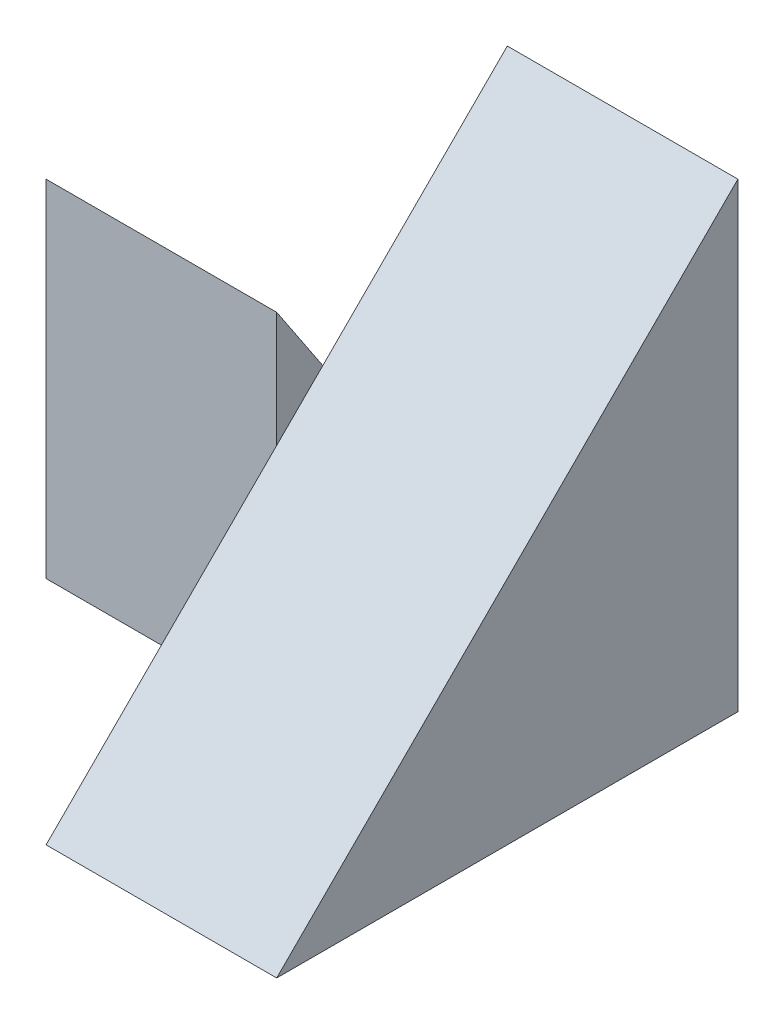
ISO-10303-21;
HEADER;
FILE_DESCRIPTION(('STEP AP214'),'2;1');
FILE_NAME('part.step','',(''),(''),'','','');
FILE_SCHEMA(('AUTOMOTIVE_DESIGN { 1 0 10303 214 1 1 1 1 }'));
ENDSEC;
DATA;
#1=APPLICATION_CONTEXT('core data for automotive mechanical design processes');
#2=APPLICATION_PROTOCOL_DEFINITION('international standard','automotive_design',2000,#1);
#3=PRODUCT_CONTEXT('',#1,'mechanical');
#4=PRODUCT('Part','Part','',(#3));
#5=PRODUCT_RELATED_PRODUCT_CATEGORY('part','',(#4));
#6=PRODUCT_DEFINITION_FORMATION('','',#4);
#7=PRODUCT_DEFINITION_CONTEXT('part definition',#1,'design');
#8=PRODUCT_DEFINITION('design','',#6,#7);
#9=PRODUCT_DEFINITION_SHAPE('','',#8);
#10=(LENGTH_UNIT() NAMED_UNIT(*) SI_UNIT(.MILLI.,.METRE.));
#11=(NAMED_UNIT(*) PLANE_ANGLE_UNIT() SI_UNIT($,.RADIAN.));
#12=(NAMED_UNIT(*) SI_UNIT($,.STERADIAN.) SOLID_ANGLE_UNIT());
#13=UNCERTAINTY_MEASURE_WITH_UNIT(LENGTH_MEASURE(1.E-05),#10,'distance_accuracy_value','');
#14=(GEOMETRIC_REPRESENTATION_CONTEXT(3) GLOBAL_UNCERTAINTY_ASSIGNED_CONTEXT((#13)) GLOBAL_UNIT_ASSIGNED_CONTEXT((#10,
#11,#12)) REPRESENTATION_CONTEXT('',''));
#15=CARTESIAN_POINT('',(0.,0.,0.));
#16=DIRECTION('',(0.,0.,1.));
#17=DIRECTION('',(1.,0.,0.));
#18=AXIS2_PLACEMENT_3D('',#15,#16,#17);
#19=CARTESIAN_POINT('',(0.,0.,0.));
#20=DIRECTION('',(-1.,0.,0.));
#21=DIRECTION('',(0.,0.,1.));
#22=AXIS2_PLACEMENT_3D('',#19,#20,#21);
#23=PLANE('',#22);
#24=DIRECTION('',(0.,0.707106781186548,-0.707106781186548));
#25=VECTOR('',#24,1.);
#26=CARTESIAN_POINT('',(0.,4.,-4.));
#27=LINE('',#26,#25);
#28=CARTESIAN_POINT('',(0.,2.4,-2.4));
#29=VERTEX_POINT('',#28);
#30=CARTESIAN_POINT('',(0.,4.,-4.));
#31=VERTEX_POINT('',#30);
#32=EDGE_CURVE('E96',#29,#31,#27,.T.);
#33=ORIENTED_EDGE('',*,*,#32,.T.);
#34=DIRECTION('',(0.,1.,0.));
#35=VECTOR('',#34,1.);
#36=CARTESIAN_POINT('',(0.,0.,-4.));
#37=LINE('',#36,#35);
#38=CARTESIAN_POINT('',(0.,0.,-4.));
#39=VERTEX_POINT('',#38);
#40=EDGE_CURVE('E102',#39,#31,#37,.T.);
#41=ORIENTED_EDGE('',*,*,#40,.F.);
#42=DIRECTION('',(0.,0.832050294337844,0.554700196225229));
#43=VECTOR('',#42,1.);
#44=CARTESIAN_POINT('',(0.,3.,-2.));
#45=LINE('',#44,#43);
#46=EDGE_CURVE('E145',#39,#29,#45,.T.);
#47=ORIENTED_EDGE('',*,*,#46,.T.);
#48=EDGE_LOOP('',(#33,#41,#47));
#49=FACE_BOUND('',#48,.T.);
#50=ADVANCED_FACE('F33',(#49),#23,.T.);
#51=CARTESIAN_POINT('',(2.,0.,-4.));
#52=DIRECTION('',(0.,0.,1.));
#53=DIRECTION('',(1.,0.,0.));
#54=AXIS2_PLACEMENT_3D('',#51,#52,#53);
#55=PLANE('',#54);
#56=DIRECTION('',(-1.,0.,0.));
#57=VECTOR('',#56,1.);
#58=CARTESIAN_POINT('',(2.,0.,-4.));
#59=LINE('',#58,#57);
#60=CARTESIAN_POINT('',(2.,0.,-4.));
#61=VERTEX_POINT('',#60);
#62=EDGE_CURVE('E42',#61,#39,#59,.T.);
#63=ORIENTED_EDGE('',*,*,#62,.T.);
#64=ORIENTED_EDGE('',*,*,#40,.T.);
#65=DIRECTION('',(-1.,0.,0.));
#66=VECTOR('',#65,1.);
#67=CARTESIAN_POINT('',(2.,4.,-4.));
#68=LINE('',#67,#66);
#69=CARTESIAN_POINT('',(2.,4.,-4.));
#70=VERTEX_POINT('',#69);
#71=EDGE_CURVE('E115',#70,#31,#68,.T.);
#72=ORIENTED_EDGE('',*,*,#71,.F.);
#73=DIRECTION('',(0.,1.,0.));
#74=VECTOR('',#73,1.);
#75=CARTESIAN_POINT('',(2.,0.,-4.));
#76=LINE('',#75,#74);
#77=EDGE_CURVE('E113',#61,#70,#76,.T.);
#78=ORIENTED_EDGE('',*,*,#77,.F.);
#79=EDGE_LOOP('',(#63,#64,#72,#78));
#80=FACE_BOUND('',#79,.T.);
#81=ADVANCED_FACE('F158',(#80),#55,.F.);
#82=CARTESIAN_POINT('',(2.,0.,0.));
#83=DIRECTION('',(0.,1.,0.));
#84=DIRECTION('',(0.,0.,1.));
#85=AXIS2_PLACEMENT_3D('',#82,#83,#84);
#86=PLANE('',#85);
#87=DIRECTION('',(0.,0.,-1.));
#88=VECTOR('',#87,1.);
#89=CARTESIAN_POINT('',(0.,0.,0.));
#90=LINE('',#89,#88);
#91=CARTESIAN_POINT('',(0.,0.,0.));
#92=VERTEX_POINT('',#91);
#93=CARTESIAN_POINT('',(0.,0.,-2.));
#94=VERTEX_POINT('',#93);
#95=EDGE_CURVE('E97',#92,#94,#90,.T.);
#96=ORIENTED_EDGE('',*,*,#95,.T.);
#97=DIRECTION('',(1.,0.,0.));
#98=VECTOR('',#97,1.);
#99=CARTESIAN_POINT('',(-2.,0.,-2.));
#100=LINE('',#99,#98);
#101=CARTESIAN_POINT('',(-2.,0.,-2.));
#102=VERTEX_POINT('',#101);
#103=EDGE_CURVE('E103',#102,#94,#100,.T.);
#104=ORIENTED_EDGE('',*,*,#103,.F.);
#105=DIRECTION('',(0.,0.,1.));
#106=VECTOR('',#105,1.);
#107=CARTESIAN_POINT('',(-2.,0.,-4.));
#108=LINE('',#107,#106);
#109=CARTESIAN_POINT('',(-2.,0.,-4.));
#110=VERTEX_POINT('',#109);
#111=EDGE_CURVE('E129',#110,#102,#108,.T.);
#112=ORIENTED_EDGE('',*,*,#111,.F.);
#113=DIRECTION('',(-1.,0.,0.));
#114=VECTOR('',#113,1.);
#115=CARTESIAN_POINT('',(0.,0.,-4.));
#116=LINE('',#115,#114);
#117=EDGE_CURVE('E130',#39,#110,#116,.T.);
#118=ORIENTED_EDGE('',*,*,#117,.F.);
#119=ORIENTED_EDGE('',*,*,#62,.F.);
#120=DIRECTION('',(0.,0.,-1.));
#121=VECTOR('',#120,1.);
#122=CARTESIAN_POINT('',(2.,0.,0.));
#123=LINE('',#122,#121);
#124=CARTESIAN_POINT('',(2.,0.,0.));
#125=VERTEX_POINT('',#124);
#126=EDGE_CURVE('E107',#125,#61,#123,.T.);
#127=ORIENTED_EDGE('',*,*,#126,.F.);
#128=DIRECTION('',(-1.,0.,0.));
#129=VECTOR('',#128,1.);
#130=CARTESIAN_POINT('',(2.,0.,0.));
#131=LINE('',#130,#129);
#132=EDGE_CURVE('E11',#125,#92,#131,.T.);
#133=ORIENTED_EDGE('',*,*,#132,.T.);
#134=EDGE_LOOP('',(#96,#104,#112,#118,#119,#127,#133));
#135=FACE_BOUND('',#134,.T.);
#136=ADVANCED_FACE('F35',(#135),#86,.F.);
#137=CARTESIAN_POINT('',(2.,0.,0.));
#138=DIRECTION('',(-1.,0.,0.));
#139=DIRECTION('',(0.,0.,1.));
#140=AXIS2_PLACEMENT_3D('',#137,#138,#139);
#141=PLANE('',#140);
#142=ORIENTED_EDGE('',*,*,#77,.T.);
#143=DIRECTION('',(0.,0.707106781186548,-0.707106781186548));
#144=VECTOR('',#143,1.);
#145=CARTESIAN_POINT('',(2.,4.,-4.));
#146=LINE('',#145,#144);
#147=EDGE_CURVE('E152',#125,#70,#146,.T.);
#148=ORIENTED_EDGE('',*,*,#147,.F.);
#149=ORIENTED_EDGE('',*,*,#126,.T.);
#150=EDGE_LOOP('',(#142,#148,#149));
#151=FACE_BOUND('',#150,.T.);
#152=ADVANCED_FACE('F160',(#151),#141,.F.);
#153=CARTESIAN_POINT('',(0.,2.,-2.));
#154=VERTEX_POINT('',#153);
#155=EDGE_CURVE('E91',#92,#154,#27,.T.);
#156=ORIENTED_EDGE('',*,*,#155,.T.);
#157=DIRECTION('',(0.,1.,0.));
#158=VECTOR('',#157,1.);
#159=CARTESIAN_POINT('',(0.,0.,-2.));
#160=LINE('',#159,#158);
#161=EDGE_CURVE('E58',#94,#154,#160,.T.);
#162=ORIENTED_EDGE('',*,*,#161,.F.);
#163=ORIENTED_EDGE('',*,*,#95,.F.);
#164=EDGE_LOOP('',(#156,#162,#163));
#165=FACE_BOUND('',#164,.T.);
#166=ADVANCED_FACE('F98',(#165),#23,.T.);
#167=CARTESIAN_POINT('',(-2.,0.,-2.));
#168=DIRECTION('',(0.,0.,-1.));
#169=DIRECTION('',(-1.,0.,0.));
#170=AXIS2_PLACEMENT_3D('',#167,#168,#169);
#171=PLANE('',#170);
#172=ORIENTED_EDGE('',*,*,#161,.T.);
#173=DIRECTION('',(0.,-1.,0.));
#174=VECTOR('',#173,1.);
#175=CARTESIAN_POINT('',(0.,0.,-2.));
#176=LINE('',#175,#174);
#177=CARTESIAN_POINT('',(0.,3.,-2.));
#178=VERTEX_POINT('',#177);
#179=EDGE_CURVE('E94',#178,#154,#176,.T.);
#180=ORIENTED_EDGE('',*,*,#179,.F.);
#181=DIRECTION('',(1.,0.,0.));
#182=VECTOR('',#181,1.);
#183=CARTESIAN_POINT('',(-2.,3.,-2.));
#184=LINE('',#183,#182);
#185=CARTESIAN_POINT('',(-2.,3.,-2.));
#186=VERTEX_POINT('',#185);
#187=EDGE_CURVE('E120',#186,#178,#184,.T.);
#188=ORIENTED_EDGE('',*,*,#187,.F.);
#189=DIRECTION('',(0.,1.,0.));
#190=VECTOR('',#189,1.);
#191=CARTESIAN_POINT('',(-2.,0.,-2.));
#192=LINE('',#191,#190);
#193=EDGE_CURVE('E135',#102,#186,#192,.T.);
#194=ORIENTED_EDGE('',*,*,#193,.F.);
#195=ORIENTED_EDGE('',*,*,#103,.T.);
#196=EDGE_LOOP('',(#172,#180,#188,#194,#195));
#197=FACE_BOUND('',#196,.T.);
#198=ADVANCED_FACE('F168',(#197),#171,.F.);
#199=CARTESIAN_POINT('',(-2.,0.,0.));
#200=DIRECTION('',(1.,0.,0.));
#201=DIRECTION('',(0.,0.,-1.));
#202=AXIS2_PLACEMENT_3D('',#199,#200,#201);
#203=PLANE('',#202);
#204=ORIENTED_EDGE('',*,*,#193,.T.);
#205=DIRECTION('',(0.,0.832050294337844,0.554700196225229));
#206=VECTOR('',#205,1.);
#207=CARTESIAN_POINT('',(-2.,3.,-2.));
#208=LINE('',#207,#206);
#209=EDGE_CURVE('E146',#110,#186,#208,.T.);
#210=ORIENTED_EDGE('',*,*,#209,.F.);
#211=ORIENTED_EDGE('',*,*,#111,.T.);
#212=EDGE_LOOP('',(#204,#210,#211));
#213=FACE_BOUND('',#212,.T.);
#214=ADVANCED_FACE('F202',(#213),#203,.F.);
#215=CARTESIAN_POINT('',(0.,3.,-2.));
#216=DIRECTION('',(0.,-0.554700196225229,0.832050294337844));
#217=DIRECTION('',(0.,-0.832050294337844,-0.554700196225229));
#218=AXIS2_PLACEMENT_3D('',#215,#216,#217);
#219=PLANE('',#218);
#220=ORIENTED_EDGE('',*,*,#209,.T.);
#221=ORIENTED_EDGE('',*,*,#187,.T.);
#222=EDGE_CURVE('E148',#29,#178,#45,.T.);
#223=ORIENTED_EDGE('',*,*,#222,.F.);
#224=ORIENTED_EDGE('',*,*,#46,.F.);
#225=ORIENTED_EDGE('',*,*,#117,.T.);
#226=EDGE_LOOP('',(#220,#221,#223,#224,#225));
#227=FACE_BOUND('',#226,.T.);
#228=ADVANCED_FACE('F209',(#227),#219,.F.);
#229=CARTESIAN_POINT('',(0.,0.,0.));
#230=DIRECTION('',(1.,0.,0.));
#231=DIRECTION('',(0.,0.,-1.));
#232=AXIS2_PLACEMENT_3D('',#229,#230,#231);
#233=PLANE('',#232);
#234=ORIENTED_EDGE('',*,*,#179,.T.);
#235=EDGE_CURVE('E50',#154,#29,#27,.T.);
#236=ORIENTED_EDGE('',*,*,#235,.T.);
#237=ORIENTED_EDGE('',*,*,#222,.T.);
#238=EDGE_LOOP('',(#234,#236,#237));
#239=FACE_BOUND('',#238,.T.);
#240=ADVANCED_FACE('F218',(#239),#233,.T.);
#241=CARTESIAN_POINT('',(0.,4.,-4.));
#242=DIRECTION('',(0.,-0.707106781186547,-0.707106781186547));
#243=DIRECTION('',(0.,0.707106781186548,-0.707106781186548));
#244=AXIS2_PLACEMENT_3D('',#241,#242,#243);
#245=PLANE('',#244);
#246=ORIENTED_EDGE('',*,*,#147,.T.);
#247=ORIENTED_EDGE('',*,*,#71,.T.);
#248=ORIENTED_EDGE('',*,*,#32,.F.);
#249=ORIENTED_EDGE('',*,*,#235,.F.);
#250=ORIENTED_EDGE('',*,*,#155,.F.);
#251=ORIENTED_EDGE('',*,*,#132,.F.);
#252=EDGE_LOOP('',(#246,#247,#248,#249,#250,#251));
#253=FACE_BOUND('',#252,.T.);
#254=ADVANCED_FACE('F92',(#253),#245,.F.);
#255=CLOSED_SHELL('',(#50,#81,#136,#152,#166,#198,#214,#228,#240,#254));
#256=MANIFOLD_SOLID_BREP('B2',#255);
#257=ADVANCED_BREP_SHAPE_REPRESENTATION('',(#18,#256),#14);
#258=SHAPE_DEFINITION_REPRESENTATION(#9,#257);
ENDSEC;
END-ISO-10303-21;
